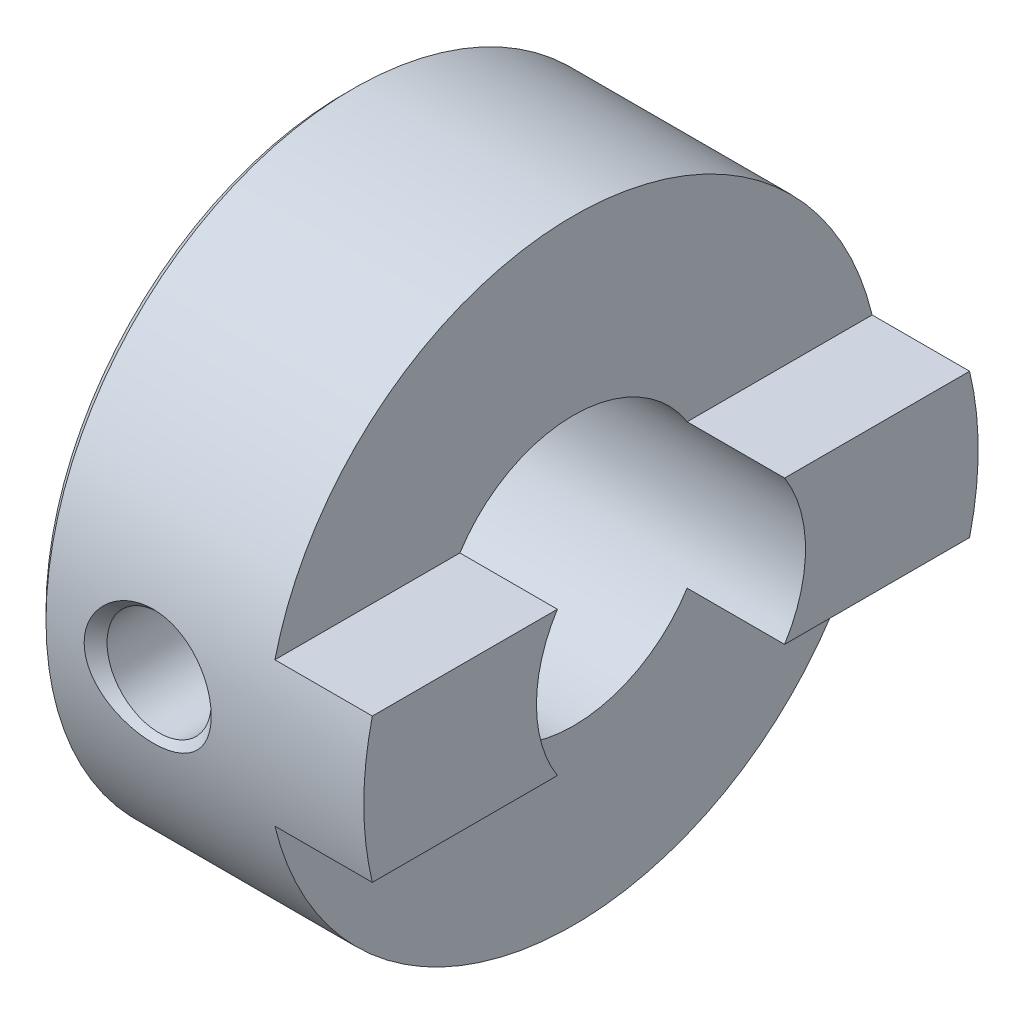
ISO-10303-21;
HEADER;
FILE_DESCRIPTION(('STEP AP214'),'2;1');
FILE_NAME('part.step','',(''),(''),'','','');
FILE_SCHEMA(('AUTOMOTIVE_DESIGN { 1 0 10303 214 1 1 1 1 }'));
ENDSEC;
DATA;
#1=APPLICATION_CONTEXT('core data for automotive mechanical design processes');
#2=APPLICATION_PROTOCOL_DEFINITION('international standard','automotive_design',2000,#1);
#3=PRODUCT_CONTEXT('',#1,'mechanical');
#4=PRODUCT('Part','Part','',(#3));
#5=PRODUCT_RELATED_PRODUCT_CATEGORY('part','',(#4));
#6=PRODUCT_DEFINITION_FORMATION('','',#4);
#7=PRODUCT_DEFINITION_CONTEXT('part definition',#1,'design');
#8=PRODUCT_DEFINITION('design','',#6,#7);
#9=PRODUCT_DEFINITION_SHAPE('','',#8);
#10=(LENGTH_UNIT() NAMED_UNIT(*) SI_UNIT(.MILLI.,.METRE.));
#11=(NAMED_UNIT(*) PLANE_ANGLE_UNIT() SI_UNIT($,.RADIAN.));
#12=(NAMED_UNIT(*) SI_UNIT($,.STERADIAN.) SOLID_ANGLE_UNIT());
#13=UNCERTAINTY_MEASURE_WITH_UNIT(LENGTH_MEASURE(1.E-05),#10,'distance_accuracy_value','');
#14=(GEOMETRIC_REPRESENTATION_CONTEXT(3) GLOBAL_UNCERTAINTY_ASSIGNED_CONTEXT((#13)) GLOBAL_UNIT_ASSIGNED_CONTEXT((#10,
#11,#12)) REPRESENTATION_CONTEXT('',''));
#15=CARTESIAN_POINT('',(0.,0.,0.));
#16=DIRECTION('',(0.,0.,1.));
#17=DIRECTION('',(1.,0.,0.));
#18=AXIS2_PLACEMENT_3D('',#15,#16,#17);
#19=CARTESIAN_POINT('',(7.7,0.,0.));
#20=DIRECTION('',(-1.,0.,0.));
#21=DIRECTION('',(0.,0.,1.));
#22=AXIS2_PLACEMENT_3D('',#19,#20,#21);
#23=CYLINDRICAL_SURFACE('',#22,3.175);
#24=CARTESIAN_POINT('',(3.8295,0.,3.175));
#25=CARTESIAN_POINT('',(3.82950316246884,-0.0664294786624814,3.17500242171082));
#26=CARTESIAN_POINT('',(3.82409970065885,-0.132838065182367,3.17289740345891));
#27=CARTESIAN_POINT('',(3.80272302614391,-0.263662191692079,3.16471157372536));
#28=CARTESIAN_POINT('',(3.78675208960495,-0.328078157752621,3.15863161842291));
#29=CARTESIAN_POINT('',(3.74489567083876,-0.45301065022601,3.14314592971077));
#30=CARTESIAN_POINT('',(3.71903008561927,-0.513534719326037,3.13374687353099));
#31=CARTESIAN_POINT('',(3.65822329725336,-0.629377660679996,3.11255213427139));
#32=CARTESIAN_POINT('',(3.62327949964512,-0.684695038747165,3.10075576627415));
#33=CARTESIAN_POINT('',(3.54367455872433,-0.791035180010789,3.07538584353735));
#34=CARTESIAN_POINT('',(3.49867774299579,-0.841793994349157,3.06175972901248));
#35=CARTESIAN_POINT('',(3.40095665963792,-0.935260844078306,3.03451586390156));
#36=CARTESIAN_POINT('',(3.34822980372346,-0.977966171889661,3.02089811765716));
#37=CARTESIAN_POINT('',(3.2339014883202,-1.05584839340471,2.99459033864622));
#38=CARTESIAN_POINT('',(3.17202400868627,-1.09064290099374,2.98196159194098));
#39=CARTESIAN_POINT('',(3.04273052700977,-1.14921295081486,2.95988540722387));
#40=CARTESIAN_POINT('',(2.97531691931914,-1.17299322741403,2.95043660282107));
#41=CARTESIAN_POINT('',(2.83991046641405,-1.20780198961705,2.93635492395465));
#42=CARTESIAN_POINT('',(2.7720681937236,-1.2193365374969,2.93153179784331));
#43=CARTESIAN_POINT('',(2.63525269813805,-1.23090815476872,2.92669326990316));
#44=CARTESIAN_POINT('',(2.56627999696491,-1.23095038659577,2.926675709378));
#45=CARTESIAN_POINT('',(2.43390134046448,-1.219921395121,2.93128711875885));
#46=CARTESIAN_POINT('',(2.37042326394498,-1.20956678141105,2.93561647412533));
#47=CARTESIAN_POINT('',(2.24618813971726,-1.17922763129579,2.94793358209464));
#48=CARTESIAN_POINT('',(2.18543153182478,-1.15924154444395,2.95592192370015));
#49=CARTESIAN_POINT('',(2.06695492679602,-1.1098356273499,2.97482751316337));
#50=CARTESIAN_POINT('',(2.00931818472526,-1.08023794003098,2.98579929035468));
#51=CARTESIAN_POINT('',(1.89962723965293,-1.01257334745646,3.00941888025505));
#52=CARTESIAN_POINT('',(1.84757506120429,-0.974503386049255,3.02206729710065));
#53=CARTESIAN_POINT('',(1.74658507485101,-0.887748092660002,3.04872579844004));
#54=CARTESIAN_POINT('',(1.6981418255311,-0.838495573955579,3.06276833255792));
#55=CARTESIAN_POINT('',(1.61005006189641,-0.732409599940694,3.08985362345725));
#56=CARTESIAN_POINT('',(1.57040308449492,-0.675574822606826,3.10289620526366));
#57=CARTESIAN_POINT('',(1.50043462435897,-0.554608212120451,3.12680287609899));
#58=CARTESIAN_POINT('',(1.47028812675353,-0.490366261076633,3.13762493401223));
#59=CARTESIAN_POINT('',(1.42139748327029,-0.357198298426019,3.15555664038321));
#60=CARTESIAN_POINT('',(1.40264792277544,-0.288274528454487,3.16266805151943));
#61=CARTESIAN_POINT('',(1.37805795697732,-0.15185367375074,3.17206181736049));
#62=CARTESIAN_POINT('',(1.37155223380326,-0.0844935413936949,3.17459274693974));
#63=CARTESIAN_POINT('',(1.36968417878421,0.0503962914320503,3.175315707468));
#64=CARTESIAN_POINT('',(1.37431917836445,0.117925947423478,3.17350877747921));
#65=CARTESIAN_POINT('',(1.39410302264331,0.248295215672026,3.16592251992033));
#66=CARTESIAN_POINT('',(1.40880721857212,0.31121313305388,3.1603112880336));
#67=CARTESIAN_POINT('',(1.44771717925287,0.433637927550875,3.14585211761305));
#68=CARTESIAN_POINT('',(1.47192417476042,0.493144361683031,3.1370037598328));
#69=CARTESIAN_POINT('',(1.52993544136872,0.609064147618344,3.11660636520741));
#70=CARTESIAN_POINT('',(1.56400618179325,0.6653308750305,3.10498418164638));
#71=CARTESIAN_POINT('',(1.64047944592404,0.771541907295075,3.0803126270155));
#72=CARTESIAN_POINT('',(1.68288518155893,0.821483762590919,3.06726270662298));
#73=CARTESIAN_POINT('',(1.77790884647394,0.916865968275205,3.04016304166223));
#74=CARTESIAN_POINT('',(1.83099645793678,0.961836253982579,3.02610141386114));
#75=CARTESIAN_POINT('',(1.94422855623846,1.0423337088102,2.99932826062202));
#76=CARTESIAN_POINT('',(2.00437391547201,1.07785970876432,2.98661690245899));
#77=CARTESIAN_POINT('',(2.13069956122794,1.13858173576398,2.96400385876961));
#78=CARTESIAN_POINT('',(2.1969174478101,1.16370723410117,2.95412149231091));
#79=CARTESIAN_POINT('',(2.33313823199498,1.20227155230261,2.93864054010872));
#80=CARTESIAN_POINT('',(2.40313853871493,1.21571826676033,2.93303906089038));
#81=CARTESIAN_POINT('',(2.5398062152297,1.22981371910523,2.92715494644977));
#82=CARTESIAN_POINT('',(2.60637635224522,1.23127088041512,2.92653639039825));
#83=CARTESIAN_POINT('',(2.73876190823769,1.22344211413962,2.92981777532719));
#84=CARTESIAN_POINT('',(2.80457740840373,1.21415735340837,2.93371722553389));
#85=CARTESIAN_POINT('',(2.93125456579968,1.18575307894,2.94530740775133));
#86=CARTESIAN_POINT('',(2.9922088827975,1.16698626154698,2.95286178980767));
#87=CARTESIAN_POINT('',(3.11013401149452,1.12047047082128,2.97082301759447));
#88=CARTESIAN_POINT('',(3.16710378157627,1.09271915940668,2.98123060572154));
#89=CARTESIAN_POINT('',(3.27884320098191,1.02725939939782,3.00443509962584));
#90=CARTESIAN_POINT('',(3.33332084154298,0.989088343570475,3.01733173875499));
#91=CARTESIAN_POINT('',(3.43535451832667,0.904569127372589,3.04373758783183));
#92=CARTESIAN_POINT('',(3.4829082730104,0.858218282700795,3.05724699778344));
#93=CARTESIAN_POINT('',(3.57262437368685,0.755378517404859,3.0843174626388));
#94=CARTESIAN_POINT('',(3.61430056429662,0.698451728564056,3.09783418362939));
#95=CARTESIAN_POINT('',(3.68749508121642,0.577924416879842,3.12256483370283));
#96=CARTESIAN_POINT('',(3.71901144259004,0.51432260621962,3.13377831718181));
#97=CARTESIAN_POINT('',(3.77260616532754,0.377414206547188,3.15329782902954));
#98=CARTESIAN_POINT('',(3.79384997695808,0.303738935517641,3.16133909682498));
#99=CARTESIAN_POINT('',(3.82229090075786,0.153365285372539,3.1721872314497));
#100=CARTESIAN_POINT('',(3.82949635007727,0.0766687281795287,3.17499720501361));
#101=CARTESIAN_POINT('',(3.8295,0.,3.175));
#102=B_SPLINE_CURVE_WITH_KNOTS('',3,(#24,#25,#26,#27,#28,#29,#30,#31,#32,#33,#34,#35,#36,#37,
#38,#39,#40,#41,#42,#43,#44,#45,#46,#47,#48,#49,#50,#51,#52,#53,#54,#55,#56,#57,#58,#59,#60,#61,
#62,#63,#64,#65,#66,#67,#68,#69,#70,#71,#72,#73,#74,#75,#76,#77,#78,#79,#80,#81,#82,#83,#84,#85,
#86,#87,#88,#89,#90,#91,#92,#93,#94,#95,#96,#97,#98,#99,#100,#101),.UNSPECIFIED.,.T.,.F.,(4,2,2,
2,2,2,2,2,2,2,2,2,2,2,2,2,2,2,2,2,2,2,2,2,2,2,2,2,2,2,2,2,2,2,2,2,2,2,4),(0.,0.199005470181675,
0.39796808981478,0.596532703801355,0.795154128103827,1.00180347461819,1.2085221731946,
1.42375253392836,1.63889029379275,1.84474285807861,2.05050295168676,2.24299212255152,
2.43551229011893,2.63181995585152,2.82819854956068,3.03872538451194,3.24928897448,
3.46353048999625,3.67767014092538,3.87979411844367,4.08186968535122,4.2755527831046,
4.46926097401526,4.66878843484423,4.86839293577599,5.08035414747807,5.29234158695384,
5.50574391026678,5.71900186591472,5.91775169698551,6.11647994064497,6.30830755950376,
6.50018513884909,6.70258577964042,6.90505296469568,7.11951218014423,7.33401284769258,
7.56382897652126,7.79350857971549),.UNSPECIFIED.);
#103=CARTESIAN_POINT('',(3.8295,0.,3.175));
#104=VERTEX_POINT('',#103);
#105=EDGE_CURVE('E147',#104,#104,#102,.T.);
#106=ORIENTED_EDGE('',*,*,#105,.F.);
#107=EDGE_LOOP('',(#106));
#108=FACE_BOUND('',#107,.T.);
#109=CARTESIAN_POINT('',(0.,0.,0.));
#110=DIRECTION('',(-1.,0.,0.));
#111=DIRECTION('',(0.,0.,1.));
#112=AXIS2_PLACEMENT_3D('',#109,#110,#111);
#113=CIRCLE('',#112,3.175);
#114=CARTESIAN_POINT('',(0.,0.,3.175));
#115=VERTEX_POINT('',#114);
#116=EDGE_CURVE('E200',#115,#115,#113,.T.);
#117=ORIENTED_EDGE('',*,*,#116,.T.);
#118=EDGE_LOOP('',(#117));
#119=FACE_BOUND('',#118,.T.);
#120=DIRECTION('',(-1.,0.,0.));
#121=VECTOR('',#120,1.);
#122=CARTESIAN_POINT('',(7.7,1.7,-2.68153407586031));
#123=LINE('',#122,#121);
#124=CARTESIAN_POINT('',(5.4,1.7,-2.68153407586031));
#125=VERTEX_POINT('',#124);
#126=CARTESIAN_POINT('',(7.7,1.7,-2.68153407586031));
#127=VERTEX_POINT('',#126);
#128=EDGE_CURVE('E215',#125,#127,#123,.F.);
#129=ORIENTED_EDGE('',*,*,#128,.F.);
#130=CARTESIAN_POINT('',(5.4,0.,0.));
#131=DIRECTION('',(1.,0.,0.));
#132=DIRECTION('',(0.,0.,-1.));
#133=AXIS2_PLACEMENT_3D('',#130,#131,#132);
#134=CIRCLE('',#133,3.175);
#135=CARTESIAN_POINT('',(5.4,1.7,2.68153407586031));
#136=VERTEX_POINT('',#135);
#137=EDGE_CURVE('E213',#136,#125,#134,.F.);
#138=ORIENTED_EDGE('',*,*,#137,.F.);
#139=DIRECTION('',(-1.,0.,0.));
#140=VECTOR('',#139,1.);
#141=CARTESIAN_POINT('',(7.7,1.7,2.68153407586031));
#142=LINE('',#141,#140);
#143=CARTESIAN_POINT('',(7.7,1.7,2.68153407586031));
#144=VERTEX_POINT('',#143);
#145=EDGE_CURVE('E217',#144,#136,#142,.T.);
#146=ORIENTED_EDGE('',*,*,#145,.F.);
#147=CARTESIAN_POINT('',(7.7,0.,0.));
#148=DIRECTION('',(-1.,0.,0.));
#149=DIRECTION('',(0.,0.,1.));
#150=AXIS2_PLACEMENT_3D('',#147,#148,#149);
#151=CIRCLE('',#150,3.175);
#152=CARTESIAN_POINT('',(7.7,-1.7,2.68153407586031));
#153=VERTEX_POINT('',#152);
#154=EDGE_CURVE('E113',#153,#144,#151,.T.);
#155=ORIENTED_EDGE('',*,*,#154,.F.);
#156=DIRECTION('',(-1.,0.,0.));
#157=VECTOR('',#156,1.);
#158=CARTESIAN_POINT('',(7.7,-1.7,2.68153407586031));
#159=LINE('',#158,#157);
#160=CARTESIAN_POINT('',(5.4,-1.7,2.68153407586031));
#161=VERTEX_POINT('',#160);
#162=EDGE_CURVE('E122',#161,#153,#159,.F.);
#163=ORIENTED_EDGE('',*,*,#162,.F.);
#164=CARTESIAN_POINT('',(5.4,-1.7,-2.68153407586031));
#165=VERTEX_POINT('',#164);
#166=EDGE_CURVE('E212',#165,#161,#134,.F.);
#167=ORIENTED_EDGE('',*,*,#166,.F.);
#168=DIRECTION('',(-1.,0.,0.));
#169=VECTOR('',#168,1.);
#170=CARTESIAN_POINT('',(7.7,-1.7,-2.68153407586031));
#171=LINE('',#170,#169);
#172=CARTESIAN_POINT('',(7.7,-1.7,-2.68153407586031));
#173=VERTEX_POINT('',#172);
#174=EDGE_CURVE('E220',#173,#165,#171,.T.);
#175=ORIENTED_EDGE('',*,*,#174,.F.);
#176=EDGE_CURVE('E205',#127,#173,#151,.T.);
#177=ORIENTED_EDGE('',*,*,#176,.F.);
#178=EDGE_LOOP('',(#129,#138,#146,#155,#163,#167,#175,#177));
#179=FACE_BOUND('',#178,.T.);
#180=CARTESIAN_POINT('',(2.6,-2.92727770291785,-1.2295));
#181=CARTESIAN_POINT('',(2.53378234428708,-2.92727447725564,-1.2295033349059));
#182=CARTESIAN_POINT('',(2.46758575700933,-2.92954885916848,-1.22413289048631));
#183=CARTESIAN_POINT('',(2.33719884888499,-2.93833101541691,-1.20289941102294));
#184=CARTESIAN_POINT('',(2.27300836988018,-2.94483845513844,-1.18703720532851));
#185=CARTESIAN_POINT('',(2.14855726051629,-2.96124138619425,-1.14549809796639));
#186=CARTESIAN_POINT('',(2.08828709857205,-2.97112826415673,-1.11984612886075));
#187=CARTESIAN_POINT('',(1.97288176950382,-2.99316174761616,-1.05954476190847));
#188=CARTESIAN_POINT('',(1.91774825513378,-3.00530907668741,-1.02489248163714));
#189=CARTESIAN_POINT('',(1.81125464900736,-3.03121684305942,-0.945604490201634));
#190=CARTESIAN_POINT('',(1.76020527323169,-3.04502684733286,-0.900567536544086));
#191=CARTESIAN_POINT('',(1.66616271822666,-3.07229196898108,-0.802638410729982));
#192=CARTESIAN_POINT('',(1.62317140781496,-3.08574700341149,-0.749744421464237));
#193=CARTESIAN_POINT('',(1.5449404171268,-3.11138028141572,-0.635216755130681));
#194=CARTESIAN_POINT('',(1.5100423466833,-3.12349370613119,-0.573333921432767));
#195=CARTESIAN_POINT('',(1.45128264816101,-3.14447923435929,-0.444023058703526));
#196=CARTESIAN_POINT('',(1.42741691760082,-3.15335254248208,-0.376597101939241));
#197=CARTESIAN_POINT('',(1.39250074763536,-3.16650587193296,-0.241383276582414));
#198=CARTESIAN_POINT('',(1.38091452155859,-3.17097726441066,-0.173752748130027));
#199=CARTESIAN_POINT('',(1.36916538055243,-3.1755121185208,-0.0373692937817417));
#200=CARTESIAN_POINT('',(1.36899850394513,-3.17557710885198,0.0313832345825042));
#201=CARTESIAN_POINT('',(1.37978963741684,-3.17141100778039,0.164203193620192));
#202=CARTESIAN_POINT('',(1.39016180204822,-3.16740614996269,0.22832657691708));
#203=CARTESIAN_POINT('',(1.42074579721794,-3.15585104073878,0.353840496131779));
#204=CARTESIAN_POINT('',(1.44095832889812,-3.14830053670098,0.415230836975718));
#205=CARTESIAN_POINT('',(1.49090083859646,-3.13025676364726,0.53462132056629));
#206=CARTESIAN_POINT('',(1.5207676117599,-3.119721484509,0.592557628630519));
#207=CARTESIAN_POINT('',(1.58904645402372,-3.09676435886255,0.702743016993319));
#208=CARTESIAN_POINT('',(1.62746137277598,-3.08434188366861,0.754990192063797));
#209=CARTESIAN_POINT('',(1.71452576913372,-3.057972403779,0.855750371768536));
#210=CARTESIAN_POINT('',(1.76366206442718,-3.04397863008215,0.903831127973081));
#211=CARTESIAN_POINT('',(1.86937054081697,-3.01664888024005,0.99123989565558));
#212=CARTESIAN_POINT('',(1.92594484545807,-3.00331309345049,1.03056539884829));
#213=CARTESIAN_POINT('',(2.04673787169922,-2.978503098593,1.10025043454689));
#214=CARTESIAN_POINT('',(2.11111249470305,-2.96708384361359,1.13036089884581));
#215=CARTESIAN_POINT('',(2.2445781350338,-2.94803892035061,1.17914612552284));
#216=CARTESIAN_POINT('',(2.31366628954056,-2.94041097229187,1.19782776180725));
#217=CARTESIAN_POINT('',(2.4503053115139,-2.93035755033077,1.22220889351825));
#218=CARTESIAN_POINT('',(2.51771229108593,-2.9276555685692,1.22859957209785));
#219=CARTESIAN_POINT('',(2.65267488195268,-2.92697472863694,1.23022211360479));
#220=CARTESIAN_POINT('',(2.7202304473381,-2.92899457339036,1.22545704099318));
#221=CARTESIAN_POINT('',(2.84988856904111,-2.93724752297979,1.20553137595058));
#222=CARTESIAN_POINT('',(2.912092084372,-2.94325628175483,1.19092373025187));
#223=CARTESIAN_POINT('',(3.03313073779797,-2.95853802652827,1.15243367872726));
#224=CARTESIAN_POINT('',(3.09196515519858,-2.96781170792645,1.12854929692624));
#225=CARTESIAN_POINT('',(3.20715298860607,-2.98902256971011,1.07113851231948));
#226=CARTESIAN_POINT('',(3.263319904264,-3.00104959099577,1.0372721193235));
#227=CARTESIAN_POINT('',(3.36941750459636,-3.02626784536557,0.961213437202177));
#228=CARTESIAN_POINT('',(3.41934576707835,-3.03945952726442,0.919017930552712));
#229=CARTESIAN_POINT('',(3.51509473974276,-3.06661067394391,0.824087559200897));
#230=CARTESIAN_POINT('',(3.56040093771076,-3.08056094048054,0.770829232628137));
#231=CARTESIAN_POINT('',(3.64150346992613,-3.10680039187676,0.657127259244025));
#232=CARTESIAN_POINT('',(3.6772996117933,-3.11908954313095,0.596683467112719));
#233=CARTESIAN_POINT('',(3.73817596336226,-3.14063497402499,0.470250929478883));
#234=CARTESIAN_POINT('',(3.76327768887067,-3.1498973343475,0.404273640007401));
#235=CARTESIAN_POINT('',(3.8018727678197,-3.16435287357065,0.268589141831316));
#236=CARTESIAN_POINT('',(3.81537198631318,-3.16954810827966,0.198883836586004));
#237=CARTESIAN_POINT('',(3.82971552703873,-3.17507729643101,0.0623571377081368));
#238=CARTESIAN_POINT('',(3.83128906517286,-3.1756913359891,-0.00437693747971259));
#239=CARTESIAN_POINT('',(3.82363644482033,-3.17273195328415,-0.137121263174393));
#240=CARTESIAN_POINT('',(3.81441173895639,-3.16915909425929,-0.20313160983442));
#241=CARTESIAN_POINT('',(3.78594168078707,-3.158361371623,-0.330710673887424));
#242=CARTESIAN_POINT('',(3.76697755070978,-3.15123915695613,-0.392351512884612));
#243=CARTESIAN_POINT('',(3.71985427995114,-3.13409447162417,-0.511573914997663));
#244=CARTESIAN_POINT('',(3.6916933991351,-3.12407145213316,-0.56915470739542));
#245=CARTESIAN_POINT('',(3.62559809016098,-3.10158037351156,-0.681351339134705));
#246=CARTESIAN_POINT('',(3.58729401365314,-3.08902539702572,-0.73573164799698));
#247=CARTESIAN_POINT('',(3.50256931164167,-3.06299885435048,-0.837512647768227));
#248=CARTESIAN_POINT('',(3.45614572018379,-3.049526954323,-0.88491077648069));
#249=CARTESIAN_POINT('',(3.35335232009472,-3.02223521994011,-0.97417800180739));
#250=CARTESIAN_POINT('',(3.29656581393226,-3.00843947540278,-1.01557655057913));
#251=CARTESIAN_POINT('',(3.17641098299774,-2.98291170213558,-1.0882796885473));
#252=CARTESIAN_POINT('',(3.1130411078322,-2.97118016128905,-1.11958189288236));
#253=CARTESIAN_POINT('',(2.97655739739214,-2.95057503469018,-1.17286675436243));
#254=CARTESIAN_POINT('',(2.90307021933721,-2.94197026194951,-1.19400937215126));
#255=CARTESIAN_POINT('',(2.753044340204,-2.93032566523828,-1.22231852873025));
#256=CARTESIAN_POINT('',(2.67650810737328,-2.92728142985906,-1.22949614683824));
#257=CARTESIAN_POINT('',(2.6,-2.92727770291785,-1.2295));
#258=B_SPLINE_CURVE_WITH_KNOTS('',3,(#180,#181,#182,#183,#184,#185,#186,#187,#188,#189,#190,
#191,#192,#193,#194,#195,#196,#197,#198,#199,#200,#201,#202,#203,#204,#205,#206,#207,#208,#209,
#210,#211,#212,#213,#214,#215,#216,#217,#218,#219,#220,#221,#222,#223,#224,#225,#226,#227,#228,
#229,#230,#231,#232,#233,#234,#235,#236,#237,#238,#239,#240,#241,#242,#243,#244,#245,#246,#247,
#248,#249,#250,#251,#252,#253,#254,#255,#256,#257),.UNSPECIFIED.,.T.,.F.,(4,2,2,2,2,2,2,2,2,2,2,
2,2,2,2,2,2,2,2,2,2,2,2,2,2,2,2,2,2,2,2,2,2,2,2,2,2,2,4),(0.,0.198367600022195,
0.396719521420282,0.59456961548729,0.792483150993539,0.999952413391158,1.20746973245732,
1.42258810127053,1.6376264117784,1.84283805377353,2.04797850199758,2.24230754284546,
2.43665043197409,2.63387753430372,2.83117048399337,3.0406935047122,3.2502764744873,
3.46510554553453,3.67980527957006,3.88203130286329,4.08420178161789,4.27586877096116,
4.4675766084087,4.66676794070655,4.8660363714369,5.07893409357242,5.29183612211677,
5.50430777264766,5.71667195574902,5.91593715603143,6.11517555344704,6.30895991096501,
6.50278095605379,6.70497470239382,6.90724246235379,7.12106530775423,7.33493862340539,
7.56431528471911,7.79350989269005),.UNSPECIFIED.);
#259=CARTESIAN_POINT('',(2.6,-2.92727770291785,-1.2295));
#260=VERTEX_POINT('',#259);
#261=EDGE_CURVE('E35',#260,#260,#258,.T.);
#262=ORIENTED_EDGE('',*,*,#261,.F.);
#263=EDGE_LOOP('',(#262));
#264=FACE_BOUND('',#263,.T.);
#265=ADVANCED_FACE('F31',(#108,#119,#179,#264),#23,.F.);
#266=CARTESIAN_POINT('',(7.7,0.,0.));
#267=DIRECTION('',(-1.,0.,0.));
#268=DIRECTION('',(0.,0.,1.));
#269=AXIS2_PLACEMENT_3D('',#266,#267,#268);
#270=CYLINDRICAL_SURFACE('',#269,7.25);
#271=CARTESIAN_POINT('',(1.58200830564529,-1.00441187640881,7.18008752364289));
#272=CARTESIAN_POINT('',(1.63578489278405,-1.04986168617137,7.17372987099769));
#273=CARTESIAN_POINT('',(1.69285744622883,-1.0914437843685,7.16747414093581));
#274=CARTESIAN_POINT('',(1.81228966583431,-1.16634368468239,7.15566782402923));
#275=CARTESIAN_POINT('',(1.87465392529839,-1.19965420638385,7.15011786046206));
#276=CARTESIAN_POINT('',(2.01679932362037,-1.26362766588196,7.13911876735613));
#277=CARTESIAN_POINT('',(2.09750518380208,-1.29229902644037,7.13393068599323));
#278=CARTESIAN_POINT('',(2.26255781731959,-1.33649004443632,7.12578417882237));
#279=CARTESIAN_POINT('',(2.34690619475528,-1.35200384414861,7.12282674616046));
#280=CARTESIAN_POINT('',(2.52065223150985,-1.36998996712848,7.11939043620564));
#281=CARTESIAN_POINT('',(2.61011263231742,-1.37188343237519,7.11902158797866));
#282=CARTESIAN_POINT('',(2.78811433738971,-1.36105760290706,7.12109896292041));
#283=CARTESIAN_POINT('',(2.87665557697855,-1.34833728684657,7.12354538284604));
#284=CARTESIAN_POINT('',(3.05121935555725,-1.30830613276614,7.13100637247181));
#285=CARTESIAN_POINT('',(3.13720746776744,-1.2808493751554,7.13604660507981));
#286=CARTESIAN_POINT('',(3.30315769567977,-1.21173912671794,7.14810554203639));
#287=CARTESIAN_POINT('',(3.38311937379568,-1.17008460618597,7.15512438987939));
#288=CARTESIAN_POINT('',(3.53281939111721,-1.07436014228975,7.17011449381119));
#289=CARTESIAN_POINT('',(3.60273478873325,-1.02056442954647,7.17806308179058));
#290=CARTESIAN_POINT('',(3.73168457584752,-0.901188410845225,7.19402326752565));
#291=CARTESIAN_POINT('',(3.79072313502557,-0.835612639940881,7.20203483990277));
#292=CARTESIAN_POINT('',(3.89176983510201,-0.699065767687178,7.21652215909619));
#293=CARTESIAN_POINT('',(3.9346557785529,-0.628753310889177,7.22306493275218));
#294=CARTESIAN_POINT('',(4.00658864830554,-0.481245793876791,7.23438650365962));
#295=CARTESIAN_POINT('',(4.03564736039825,-0.404056661946941,7.23916680239026));
#296=CARTESIAN_POINT('',(4.07618067207471,-0.253293693342394,7.24592730796786));
#297=CARTESIAN_POINT('',(4.08911394050319,-0.180121088254738,7.24813828678803));
#298=CARTESIAN_POINT('',(4.10176888975318,-0.0326184047054376,7.25030100569326));
#299=CARTESIAN_POINT('',(4.10149631308732,0.041711156601682,7.25025372777298));
#300=CARTESIAN_POINT('',(4.08820817586898,0.184383945543079,7.24798414988832));
#301=CARTESIAN_POINT('',(4.07600481823865,0.252807068196405,7.24590048292978));
#302=CARTESIAN_POINT('',(4.04060949728902,0.386657988093955,7.23999211790296));
#303=CARTESIAN_POINT('',(4.01741713207762,0.452085675692575,7.23616735615924));
#304=CARTESIAN_POINT('',(3.96051204781662,0.579435634433251,7.22709524930008));
#305=CARTESIAN_POINT('',(3.92662374278215,0.64127736804729,7.22182436848898));
#306=CARTESIAN_POINT('',(3.8497192608264,0.758894573948918,7.21041449239855));
#307=CARTESIAN_POINT('',(3.80670040557847,0.814668258977202,7.20427524257127));
#308=CARTESIAN_POINT('',(3.70914137095142,0.923325338320132,7.19118919407236));
#309=CARTESIAN_POINT('',(3.65395734780279,0.975626981988899,7.18421698925729));
#310=CARTESIAN_POINT('',(3.53619073599058,1.07114619999515,7.17059821491746));
#311=CARTESIAN_POINT('',(3.47360525829482,1.11436020872209,7.16395177399041));
#312=CARTESIAN_POINT('',(3.33665332172002,1.19458953746153,7.15103215175697));
#313=CARTESIAN_POINT('',(3.26173286710323,1.23067513006905,7.14484885376223));
#314=CARTESIAN_POINT('',(3.10705718425124,1.29069806927207,7.13425045930504));
#315=CARTESIAN_POINT('',(3.02730052661362,1.31463180444377,7.12983588857469));
#316=CARTESIAN_POINT('',(2.8600321862052,1.35105018722601,7.12302843823919));
#317=CARTESIAN_POINT('',(2.77234356407695,1.36275222818191,7.1207744451249));
#318=CARTESIAN_POINT('',(2.59619523462123,1.37185894546039,7.11902547397831));
#319=CARTESIAN_POINT('',(2.50773540865226,1.36926138175978,7.11953092821143));
#320=CARTESIAN_POINT('',(2.33061126879319,1.34960613141039,7.12328338346153));
#321=CARTESIAN_POINT('',(2.24198131585001,1.33224738498813,7.12658745781934));
#322=CARTESIAN_POINT('',(2.06897237582656,1.28297633307368,7.13562151934399));
#323=CARTESIAN_POINT('',(1.98459381058273,1.25106258653289,7.14135174671321));
#324=CARTESIAN_POINT('',(1.82339727023525,1.17360665959709,7.15448608356551));
#325=CARTESIAN_POINT('',(1.74651841092376,1.12818895340395,7.16187475988556));
#326=CARTESIAN_POINT('',(1.60205504614399,1.02447186153392,7.17744361372084));
#327=CARTESIAN_POINT('',(1.53446899231729,0.966174626061896,7.18562365899105));
#328=CARTESIAN_POINT('',(1.41434197676091,0.841167557071238,7.20129836482031));
#329=CARTESIAN_POINT('',(1.36122070886127,0.775018991504764,7.20880689105407));
#330=CARTESIAN_POINT('',(1.26817419775783,0.63389110916314,7.22258155112997));
#331=CARTESIAN_POINT('',(1.22823870201042,0.558918715143412,7.22884864871574));
#332=CARTESIAN_POINT('',(1.16673090415709,0.409859581690512,7.23875387776177));
#333=CARTESIAN_POINT('',(1.1437848535595,0.336352629089151,7.2425838198878));
#334=CARTESIAN_POINT('',(1.11166697875233,0.186318789306052,7.24799293238601));
#335=CARTESIAN_POINT('',(1.10248608704101,0.109793924240928,7.2495735843946));
#336=CARTESIAN_POINT('',(1.09856708002886,-0.0371624105618861,7.2502458733885));
#337=CARTESIAN_POINT('',(1.10267880857037,-0.107564850675874,7.24953573502622));
#338=CARTESIAN_POINT('',(1.12266051183263,-0.246628476202496,7.24613765697439));
#339=CARTESIAN_POINT('',(1.1385305372985,-0.315289654099066,7.24344970874923));
#340=CARTESIAN_POINT('',(1.18105536096362,-0.44820883014545,7.23643532002251));
#341=CARTESIAN_POINT('',(1.20758616009768,-0.512507843662707,7.23212775367172));
#342=CARTESIAN_POINT('',(1.27036332146251,-0.636038184498317,7.22231246455589));
#343=CARTESIAN_POINT('',(1.30660754976289,-0.69527062112042,7.21680500544335));
#344=CARTESIAN_POINT('',(1.38084391813178,-0.79820968952281,7.20607963615762));
#345=CARTESIAN_POINT('',(1.4175529831974,-0.842863136661078,7.2009647742634));
#346=CARTESIAN_POINT('',(1.49610740984216,-0.927346361084062,7.19057295923222));
#347=CARTESIAN_POINT('',(1.5379517769681,-0.967177069335422,7.18529603762613));
#348=CARTESIAN_POINT('',(1.58200830564529,-1.00441187640881,7.18008752364289));
#349=B_SPLINE_CURVE_WITH_KNOTS('',3,(#271,#272,#273,#274,#275,#276,#277,#278,#279,#280,#281,
#282,#283,#284,#285,#286,#287,#288,#289,#290,#291,#292,#293,#294,#295,#296,#297,#298,#299,#300,
#301,#302,#303,#304,#305,#306,#307,#308,#309,#310,#311,#312,#313,#314,#315,#316,#317,#318,#319,
#320,#321,#322,#323,#324,#325,#326,#327,#328,#329,#330,#331,#332,#333,#334,#335,#336,#337,#338,
#339,#340,#341,#342,#343,#344,#345,#346,#347,#348),.UNSPECIFIED.,.T.,.F.,(4,2,2,2,2,2,2,2,2,2,2,
2,2,2,2,2,2,2,2,2,2,2,2,2,2,2,2,2,2,2,2,2,2,2,2,2,2,2,4),(0.,0.211938643284731,
0.424063173171912,0.680306178414661,0.936663202843584,1.20385421472871,1.47106390151892,
1.74096966424346,2.01089500628775,2.27524467692895,2.53949279622624,2.78598439679511,
3.03226551954191,3.25410969475752,3.47585740272509,3.68349073542137,3.89113166230997,
4.10237599855491,4.31368238639661,4.54177808574879,4.76996311408858,5.01903918441396,
5.268189234664,5.5324533792992,5.79675892190776,6.06658804235083,6.33644388359847,
6.60388559171092,6.87128268480002,7.12540591048332,7.37933107579475,7.60937608477173,
7.83926948987682,8.04982077901012,8.26037297682207,8.46854395674077,8.67666924128815,
8.85033378723575,9.02396475588732),.UNSPECIFIED.);
#350=CARTESIAN_POINT('',(1.58200830564529,-1.00441187640881,7.18008752364289));
#351=VERTEX_POINT('',#350);
#352=EDGE_CURVE('E44',#351,#351,#349,.T.);
#353=ORIENTED_EDGE('',*,*,#352,.F.);
#354=EDGE_LOOP('',(#353));
#355=FACE_BOUND('',#354,.T.);
#356=CARTESIAN_POINT('',(0.2,0.,0.));
#357=DIRECTION('',(-1.,0.,0.));
#358=DIRECTION('',(0.,0.,1.));
#359=AXIS2_PLACEMENT_3D('',#356,#357,#358);
#360=CIRCLE('',#359,7.25);
#361=CARTESIAN_POINT('',(0.2,0.,7.25));
#362=VERTEX_POINT('',#361);
#363=EDGE_CURVE('E209',#362,#362,#360,.T.);
#364=ORIENTED_EDGE('',*,*,#363,.F.);
#365=EDGE_LOOP('',(#364));
#366=FACE_BOUND('',#365,.T.);
#367=DIRECTION('',(-1.,0.,0.));
#368=VECTOR('',#367,1.);
#369=CARTESIAN_POINT('',(7.7,1.7,-7.04787201926936));
#370=LINE('',#369,#368);
#371=CARTESIAN_POINT('',(7.7,1.7,-7.04787201926936));
#372=VERTEX_POINT('',#371);
#373=CARTESIAN_POINT('',(5.4,1.7,-7.04787201926936));
#374=VERTEX_POINT('',#373);
#375=EDGE_CURVE('E139',#372,#374,#370,.T.);
#376=ORIENTED_EDGE('',*,*,#375,.F.);
#377=CARTESIAN_POINT('',(7.7,0.,0.));
#378=DIRECTION('',(-1.,0.,0.));
#379=DIRECTION('',(0.,0.,1.));
#380=AXIS2_PLACEMENT_3D('',#377,#378,#379);
#381=CIRCLE('',#380,7.25);
#382=CARTESIAN_POINT('',(7.7,-1.7,-7.04787201926936));
#383=VERTEX_POINT('',#382);
#384=EDGE_CURVE('E114',#372,#383,#381,.T.);
#385=ORIENTED_EDGE('',*,*,#384,.T.);
#386=DIRECTION('',(-1.,0.,0.));
#387=VECTOR('',#386,1.);
#388=CARTESIAN_POINT('',(7.7,-1.7,-7.04787201926936));
#389=LINE('',#388,#387);
#390=CARTESIAN_POINT('',(5.4,-1.7,-7.04787201926936));
#391=VERTEX_POINT('',#390);
#392=EDGE_CURVE('E135',#391,#383,#389,.F.);
#393=ORIENTED_EDGE('',*,*,#392,.F.);
#394=CARTESIAN_POINT('',(5.4,0.,0.));
#395=DIRECTION('',(1.,0.,0.));
#396=DIRECTION('',(0.,0.,-1.));
#397=AXIS2_PLACEMENT_3D('',#394,#395,#396);
#398=CIRCLE('',#397,7.25);
#399=CARTESIAN_POINT('',(5.4,-1.7,7.04787201926936));
#400=VERTEX_POINT('',#399);
#401=EDGE_CURVE('E130',#400,#391,#398,.T.);
#402=ORIENTED_EDGE('',*,*,#401,.F.);
#403=DIRECTION('',(-1.,0.,0.));
#404=VECTOR('',#403,1.);
#405=CARTESIAN_POINT('',(7.7,-1.7,7.04787201926936));
#406=LINE('',#405,#404);
#407=CARTESIAN_POINT('',(7.7,-1.7,7.04787201926936));
#408=VERTEX_POINT('',#407);
#409=EDGE_CURVE('E119',#408,#400,#406,.T.);
#410=ORIENTED_EDGE('',*,*,#409,.F.);
#411=CARTESIAN_POINT('',(7.7,1.7,7.04787201926936));
#412=VERTEX_POINT('',#411);
#413=EDGE_CURVE('E103',#408,#412,#381,.T.);
#414=ORIENTED_EDGE('',*,*,#413,.T.);
#415=DIRECTION('',(-1.,0.,0.));
#416=VECTOR('',#415,1.);
#417=CARTESIAN_POINT('',(7.7,1.7,7.04787201926936));
#418=LINE('',#417,#416);
#419=CARTESIAN_POINT('',(5.4,1.7,7.04787201926936));
#420=VERTEX_POINT('',#419);
#421=EDGE_CURVE('E131',#420,#412,#418,.F.);
#422=ORIENTED_EDGE('',*,*,#421,.F.);
#423=EDGE_CURVE('E133',#374,#420,#398,.T.);
#424=ORIENTED_EDGE('',*,*,#423,.F.);
#425=EDGE_LOOP('',(#376,#385,#393,#402,#410,#414,#422,#424));
#426=FACE_BOUND('',#425,.T.);
#427=CARTESIAN_POINT('',(1.58200830564529,-7.18008752364289,-1.00441187640881));
#428=CARTESIAN_POINT('',(1.63578489278405,-7.17372987099769,-1.04986168617137));
#429=CARTESIAN_POINT('',(1.69285744622883,-7.16747414093581,-1.0914437843685));
#430=CARTESIAN_POINT('',(1.81228966583431,-7.15566782402923,-1.16634368468239));
#431=CARTESIAN_POINT('',(1.87465392529839,-7.15011786046206,-1.19965420638385));
#432=CARTESIAN_POINT('',(2.01679932362037,-7.13911876735613,-1.26362766588195));
#433=CARTESIAN_POINT('',(2.09750518380208,-7.13393068599323,-1.29229902644037));
#434=CARTESIAN_POINT('',(2.26255781731959,-7.12578417882237,-1.33649004443632));
#435=CARTESIAN_POINT('',(2.34690619475528,-7.12282674616046,-1.35200384414861));
#436=CARTESIAN_POINT('',(2.52065223150985,-7.11939043620564,-1.36998996712848));
#437=CARTESIAN_POINT('',(2.61011263231742,-7.11902158797866,-1.37188343237519));
#438=CARTESIAN_POINT('',(2.78811433738971,-7.12109896292041,-1.36105760290706));
#439=CARTESIAN_POINT('',(2.87665557697855,-7.12354538284604,-1.34833728684657));
#440=CARTESIAN_POINT('',(3.05121935555725,-7.13100637247181,-1.30830613276614));
#441=CARTESIAN_POINT('',(3.13720746776744,-7.13604660507981,-1.2808493751554));
#442=CARTESIAN_POINT('',(3.30315769567977,-7.14810554203639,-1.21173912671794));
#443=CARTESIAN_POINT('',(3.38311937379568,-7.15512438987939,-1.17008460618597));
#444=CARTESIAN_POINT('',(3.5328193911172,-7.17011449381119,-1.07436014228975));
#445=CARTESIAN_POINT('',(3.60273478873325,-7.17806308179058,-1.02056442954647));
#446=CARTESIAN_POINT('',(3.73168457584752,-7.19402326752565,-0.901188410845225));
#447=CARTESIAN_POINT('',(3.79072313502557,-7.20203483990277,-0.835612639940882));
#448=CARTESIAN_POINT('',(3.89176983510201,-7.21652215909619,-0.699065767687178));
#449=CARTESIAN_POINT('',(3.9346557785529,-7.22306493275218,-0.628753310889178));
#450=CARTESIAN_POINT('',(4.00658864830554,-7.23438650365962,-0.481245793876792));
#451=CARTESIAN_POINT('',(4.03564736039825,-7.23916680239026,-0.404056661946942));
#452=CARTESIAN_POINT('',(4.07618067207471,-7.24592730796786,-0.253293693342395));
#453=CARTESIAN_POINT('',(4.08911394050318,-7.24813828678803,-0.180121088254738));
#454=CARTESIAN_POINT('',(4.10176888975318,-7.25030100569326,-0.0326184047054377));
#455=CARTESIAN_POINT('',(4.10149631308732,-7.25025372777298,0.0417111566016818));
#456=CARTESIAN_POINT('',(4.08820817586898,-7.24798414988832,0.184383945543078));
#457=CARTESIAN_POINT('',(4.07600481823865,-7.24590048292978,0.252807068196405));
#458=CARTESIAN_POINT('',(4.04060949728902,-7.23999211790296,0.386657988093955));
#459=CARTESIAN_POINT('',(4.01741713207762,-7.23616735615924,0.452085675692574));
#460=CARTESIAN_POINT('',(3.96051204781662,-7.22709524930008,0.579435634433251));
#461=CARTESIAN_POINT('',(3.92662374278215,-7.22182436848898,0.64127736804729));
#462=CARTESIAN_POINT('',(3.8497192608264,-7.21041449239855,0.758894573948917));
#463=CARTESIAN_POINT('',(3.80670040557847,-7.20427524257127,0.814668258977201));
#464=CARTESIAN_POINT('',(3.70914137095142,-7.19118919407236,0.923325338320132));
#465=CARTESIAN_POINT('',(3.65395734780279,-7.18421698925729,0.975626981988899));
#466=CARTESIAN_POINT('',(3.53619073599058,-7.17059821491746,1.07114619999515));
#467=CARTESIAN_POINT('',(3.47360525829482,-7.16395177399041,1.11436020872209));
#468=CARTESIAN_POINT('',(3.33665332172002,-7.15103215175697,1.19458953746153));
#469=CARTESIAN_POINT('',(3.26173286710323,-7.14484885376223,1.23067513006905));
#470=CARTESIAN_POINT('',(3.10705718425124,-7.13425045930504,1.29069806927207));
#471=CARTESIAN_POINT('',(3.02730052661362,-7.12983588857469,1.31463180444377));
#472=CARTESIAN_POINT('',(2.8600321862052,-7.12302843823919,1.35105018722601));
#473=CARTESIAN_POINT('',(2.77234356407695,-7.1207744451249,1.36275222818191));
#474=CARTESIAN_POINT('',(2.59619523462123,-7.11902547397831,1.37185894546039));
#475=CARTESIAN_POINT('',(2.50773540865226,-7.11953092821143,1.36926138175978));
#476=CARTESIAN_POINT('',(2.33061126879319,-7.12328338346153,1.34960613141039));
#477=CARTESIAN_POINT('',(2.24198131585001,-7.12658745781934,1.33224738498813));
#478=CARTESIAN_POINT('',(2.06897237582656,-7.13562151934399,1.28297633307368));
#479=CARTESIAN_POINT('',(1.98459381058273,-7.14135174671321,1.25106258653289));
#480=CARTESIAN_POINT('',(1.82339727023525,-7.15448608356551,1.17360665959709));
#481=CARTESIAN_POINT('',(1.74651841092376,-7.16187475988556,1.12818895340395));
#482=CARTESIAN_POINT('',(1.602055046144,-7.17744361372084,1.02447186153392));
#483=CARTESIAN_POINT('',(1.53446899231729,-7.18562365899105,0.966174626061897));
#484=CARTESIAN_POINT('',(1.41434197676091,-7.20129836482031,0.84116755707124));
#485=CARTESIAN_POINT('',(1.36122070886127,-7.20880689105407,0.775018991504765));
#486=CARTESIAN_POINT('',(1.26817419775783,-7.22258155112997,0.633891109163142));
#487=CARTESIAN_POINT('',(1.22823870201042,-7.22884864871574,0.558918715143413));
#488=CARTESIAN_POINT('',(1.16673090415709,-7.23875387776177,0.409859581690513));
#489=CARTESIAN_POINT('',(1.1437848535595,-7.2425838198878,0.336352629089152));
#490=CARTESIAN_POINT('',(1.11166697875233,-7.24799293238601,0.186318789306053));
#491=CARTESIAN_POINT('',(1.10248608704101,-7.2495735843946,0.109793924240929));
#492=CARTESIAN_POINT('',(1.09856708002886,-7.2502458733885,-0.0371624105618858));
#493=CARTESIAN_POINT('',(1.10267880857037,-7.24953573502622,-0.107564850675874));
#494=CARTESIAN_POINT('',(1.12266051183263,-7.24613765697439,-0.246628476202496));
#495=CARTESIAN_POINT('',(1.1385305372985,-7.24344970874923,-0.315289654099065));
#496=CARTESIAN_POINT('',(1.18105536096362,-7.23643532002251,-0.448208830145449));
#497=CARTESIAN_POINT('',(1.20758616009768,-7.23212775367172,-0.512507843662706));
#498=CARTESIAN_POINT('',(1.27036332146251,-7.22231246455589,-0.636038184498316));
#499=CARTESIAN_POINT('',(1.3066075497629,-7.21680500544335,-0.695270621120419));
#500=CARTESIAN_POINT('',(1.38084391813178,-7.20607963615762,-0.798209689522809));
#501=CARTESIAN_POINT('',(1.4175529831974,-7.2009647742634,-0.842863136661076));
#502=CARTESIAN_POINT('',(1.49610740984216,-7.19057295923222,-0.927346361084061));
#503=CARTESIAN_POINT('',(1.5379517769681,-7.18529603762613,-0.967177069335421));
#504=CARTESIAN_POINT('',(1.58200830564529,-7.18008752364289,-1.00441187640881));
#505=B_SPLINE_CURVE_WITH_KNOTS('',3,(#427,#428,#429,#430,#431,#432,#433,#434,#435,#436,#437,
#438,#439,#440,#441,#442,#443,#444,#445,#446,#447,#448,#449,#450,#451,#452,#453,#454,#455,#456,
#457,#458,#459,#460,#461,#462,#463,#464,#465,#466,#467,#468,#469,#470,#471,#472,#473,#474,#475,
#476,#477,#478,#479,#480,#481,#482,#483,#484,#485,#486,#487,#488,#489,#490,#491,#492,#493,#494,
#495,#496,#497,#498,#499,#500,#501,#502,#503,#504),.UNSPECIFIED.,.T.,.F.,(4,2,2,2,2,2,2,2,2,2,2,
2,2,2,2,2,2,2,2,2,2,2,2,2,2,2,2,2,2,2,2,2,2,2,2,2,2,2,4),(0.,0.211938643284731,
0.424063173171911,0.68030617841466,0.936663202843583,1.20385421472871,1.47106390151892,
1.74096966424346,2.01089500628775,2.27524467692895,2.53949279622623,2.78598439679511,
3.0322655195419,3.25410969475752,3.47585740272509,3.68349073542137,3.89113166230996,
4.10237599855491,4.31368238639661,4.54177808574879,4.76996311408858,5.01903918441396,
5.268189234664,5.53245337929919,5.79675892190776,6.06658804235083,6.33644388359846,
6.60388559171092,6.87128268480002,7.12540591048331,7.37933107579475,7.60937608477172,
7.83926948987682,8.04982077901012,8.26037297682207,8.46854395674077,8.67666924128815,
8.85033378723574,9.02396475588731),.UNSPECIFIED.);
#506=CARTESIAN_POINT('',(1.58200830564529,-7.18008752364289,-1.00441187640881));
#507=VERTEX_POINT('',#506);
#508=EDGE_CURVE('E11',#507,#507,#505,.T.);
#509=ORIENTED_EDGE('',*,*,#508,.F.);
#510=EDGE_LOOP('',(#509));
#511=FACE_BOUND('',#510,.T.);
#512=ADVANCED_FACE('F127',(#355,#366,#426,#511),#270,.T.);
#513=CARTESIAN_POINT('',(7.7,3.175,0.));
#514=DIRECTION('',(-1.,0.,0.));
#515=DIRECTION('',(0.,0.,1.));
#516=AXIS2_PLACEMENT_3D('',#513,#514,#515);
#517=PLANE('',#516);
#518=DIRECTION('',(0.,0.,1.));
#519=VECTOR('',#518,1.);
#520=CARTESIAN_POINT('',(7.7,1.7,-7.25));
#521=LINE('',#520,#519);
#522=EDGE_CURVE('E109',#144,#412,#521,.T.);
#523=ORIENTED_EDGE('',*,*,#522,.T.);
#524=ORIENTED_EDGE('',*,*,#413,.F.);
#525=DIRECTION('',(0.,0.,-1.));
#526=VECTOR('',#525,1.);
#527=CARTESIAN_POINT('',(7.7,-1.7,7.25));
#528=LINE('',#527,#526);
#529=EDGE_CURVE('E107',#408,#153,#528,.T.);
#530=ORIENTED_EDGE('',*,*,#529,.T.);
#531=ORIENTED_EDGE('',*,*,#154,.T.);
#532=EDGE_LOOP('',(#523,#524,#530,#531));
#533=FACE_BOUND('',#532,.T.);
#534=ADVANCED_FACE('F105',(#533),#517,.F.);
#535=EDGE_CURVE('E224',#372,#127,#521,.T.);
#536=ORIENTED_EDGE('',*,*,#535,.T.);
#537=ORIENTED_EDGE('',*,*,#176,.T.);
#538=EDGE_CURVE('E123',#173,#383,#528,.T.);
#539=ORIENTED_EDGE('',*,*,#538,.T.);
#540=ORIENTED_EDGE('',*,*,#384,.F.);
#541=EDGE_LOOP('',(#536,#537,#539,#540));
#542=FACE_BOUND('',#541,.T.);
#543=ADVANCED_FACE('F195',(#542),#517,.F.);
#544=CARTESIAN_POINT('',(0.2,0.,0.));
#545=DIRECTION('',(1.,0.,0.));
#546=DIRECTION('',(0.,0.,-1.));
#547=AXIS2_PLACEMENT_3D('',#544,#545,#546);
#548=CONICAL_SURFACE('',#547,7.25,0.78539816339745);
#549=CARTESIAN_POINT('',(0.,0.,0.));
#550=DIRECTION('',(-1.,0.,0.));
#551=DIRECTION('',(0.,0.,1.));
#552=AXIS2_PLACEMENT_3D('',#549,#550,#551);
#553=CIRCLE('',#552,7.05);
#554=CARTESIAN_POINT('',(0.,0.,7.05));
#555=VERTEX_POINT('',#554);
#556=EDGE_CURVE('E203',#555,#555,#553,.T.);
#557=ORIENTED_EDGE('',*,*,#556,.F.);
#558=EDGE_LOOP('',(#557));
#559=FACE_BOUND('',#558,.T.);
#560=ORIENTED_EDGE('',*,*,#363,.T.);
#561=EDGE_LOOP('',(#560));
#562=FACE_BOUND('',#561,.T.);
#563=ADVANCED_FACE('F33',(#559,#562),#548,.T.);
#564=CARTESIAN_POINT('',(0.,7.05,0.));
#565=DIRECTION('',(1.,0.,0.));
#566=DIRECTION('',(0.,0.,-1.));
#567=AXIS2_PLACEMENT_3D('',#564,#565,#566);
#568=PLANE('',#567);
#569=ORIENTED_EDGE('',*,*,#116,.F.);
#570=EDGE_LOOP('',(#569));
#571=FACE_BOUND('',#570,.T.);
#572=ORIENTED_EDGE('',*,*,#556,.T.);
#573=EDGE_LOOP('',(#572));
#574=FACE_BOUND('',#573,.T.);
#575=ADVANCED_FACE('F166',(#571,#574),#568,.F.);
#576=CARTESIAN_POINT('',(5.4,-1.7,7.25));
#577=DIRECTION('',(0.,-1.,0.));
#578=DIRECTION('',(0.,0.,-1.));
#579=AXIS2_PLACEMENT_3D('',#576,#577,#578);
#580=PLANE('',#579);
#581=ORIENTED_EDGE('',*,*,#162,.T.);
#582=ORIENTED_EDGE('',*,*,#529,.F.);
#583=ORIENTED_EDGE('',*,*,#409,.T.);
#584=DIRECTION('',(0.,0.,-1.));
#585=VECTOR('',#584,1.);
#586=CARTESIAN_POINT('',(5.4,-1.7,7.25));
#587=LINE('',#586,#585);
#588=EDGE_CURVE('E221',#400,#161,#587,.T.);
#589=ORIENTED_EDGE('',*,*,#588,.T.);
#590=EDGE_LOOP('',(#581,#582,#583,#589));
#591=FACE_BOUND('',#590,.T.);
#592=ADVANCED_FACE('F117',(#591),#580,.T.);
#593=ORIENTED_EDGE('',*,*,#174,.T.);
#594=EDGE_CURVE('E59',#165,#391,#587,.T.);
#595=ORIENTED_EDGE('',*,*,#594,.T.);
#596=ORIENTED_EDGE('',*,*,#392,.T.);
#597=ORIENTED_EDGE('',*,*,#538,.F.);
#598=EDGE_LOOP('',(#593,#595,#596,#597));
#599=FACE_BOUND('',#598,.T.);
#600=ADVANCED_FACE('F165',(#599),#580,.T.);
#601=CARTESIAN_POINT('',(5.4,7.75,8.25));
#602=DIRECTION('',(1.,0.,0.));
#603=DIRECTION('',(0.,0.,-1.));
#604=AXIS2_PLACEMENT_3D('',#601,#602,#603);
#605=PLANE('',#604);
#606=ORIENTED_EDGE('',*,*,#166,.T.);
#607=ORIENTED_EDGE('',*,*,#588,.F.);
#608=ORIENTED_EDGE('',*,*,#401,.T.);
#609=ORIENTED_EDGE('',*,*,#594,.F.);
#610=EDGE_LOOP('',(#606,#607,#608,#609));
#611=FACE_BOUND('',#610,.T.);
#612=ADVANCED_FACE('F172',(#611),#605,.T.);
#613=ORIENTED_EDGE('',*,*,#137,.T.);
#614=DIRECTION('',(0.,0.,1.));
#615=VECTOR('',#614,1.);
#616=CARTESIAN_POINT('',(5.4,1.7,-7.25));
#617=LINE('',#616,#615);
#618=EDGE_CURVE('E227',#374,#125,#617,.T.);
#619=ORIENTED_EDGE('',*,*,#618,.F.);
#620=ORIENTED_EDGE('',*,*,#423,.T.);
#621=EDGE_CURVE('E51',#136,#420,#617,.T.);
#622=ORIENTED_EDGE('',*,*,#621,.F.);
#623=EDGE_LOOP('',(#613,#619,#620,#622));
#624=FACE_BOUND('',#623,.T.);
#625=ADVANCED_FACE('F170',(#624),#605,.T.);
#626=CARTESIAN_POINT('',(5.4,1.7,-7.25));
#627=DIRECTION('',(0.,1.,0.));
#628=DIRECTION('',(0.,0.,1.));
#629=AXIS2_PLACEMENT_3D('',#626,#627,#628);
#630=PLANE('',#629);
#631=ORIENTED_EDGE('',*,*,#128,.T.);
#632=ORIENTED_EDGE('',*,*,#535,.F.);
#633=ORIENTED_EDGE('',*,*,#375,.T.);
#634=ORIENTED_EDGE('',*,*,#618,.T.);
#635=EDGE_LOOP('',(#631,#632,#633,#634));
#636=FACE_BOUND('',#635,.T.);
#637=ADVANCED_FACE('F167',(#636),#630,.T.);
#638=ORIENTED_EDGE('',*,*,#145,.T.);
#639=ORIENTED_EDGE('',*,*,#621,.T.);
#640=ORIENTED_EDGE('',*,*,#421,.T.);
#641=ORIENTED_EDGE('',*,*,#522,.F.);
#642=EDGE_LOOP('',(#638,#639,#640,#641));
#643=FACE_BOUND('',#642,.T.);
#644=ADVANCED_FACE('F169',(#643),#630,.T.);
#645=CARTESIAN_POINT('',(2.6,0.,0.));
#646=DIRECTION('',(0.,0.,1.));
#647=DIRECTION('',(1.,0.,0.));
#648=AXIS2_PLACEMENT_3D('',#645,#646,#647);
#649=CYLINDRICAL_SURFACE('',#648,1.2295);
#650=CARTESIAN_POINT('',(2.6,0.,6.9795));
#651=DIRECTION('',(0.,0.,1.));
#652=DIRECTION('',(1.,0.,0.));
#653=AXIS2_PLACEMENT_3D('',#650,#651,#652);
#654=CIRCLE('',#653,1.2295);
#655=CARTESIAN_POINT('',(3.8295,0.,6.9795));
#656=VERTEX_POINT('',#655);
#657=EDGE_CURVE('E229',#656,#656,#654,.T.);
#658=ORIENTED_EDGE('',*,*,#657,.T.);
#659=EDGE_LOOP('',(#658));
#660=FACE_BOUND('',#659,.T.);
#661=ORIENTED_EDGE('',*,*,#105,.T.);
#662=EDGE_LOOP('',(#661));
#663=FACE_BOUND('',#662,.T.);
#664=ADVANCED_FACE('F159',(#660,#663),#649,.F.);
#665=CARTESIAN_POINT('',(2.6,0.,6.9795));
#666=DIRECTION('',(0.,0.,1.));
#667=DIRECTION('',(1.,0.,0.));
#668=AXIS2_PLACEMENT_3D('',#665,#666,#667);
#669=CONICAL_SURFACE('',#668,1.2295,0.785398163397447);
#670=ORIENTED_EDGE('',*,*,#657,.F.);
#671=EDGE_LOOP('',(#670));
#672=FACE_BOUND('',#671,.T.);
#673=ORIENTED_EDGE('',*,*,#352,.T.);
#674=EDGE_LOOP('',(#673));
#675=FACE_BOUND('',#674,.T.);
#676=ADVANCED_FACE('F154',(#672,#675),#669,.F.);
#677=CARTESIAN_POINT('',(2.6,0.,0.));
#678=DIRECTION('',(0.,-1.,0.));
#679=DIRECTION('',(0.,0.,-1.));
#680=AXIS2_PLACEMENT_3D('',#677,#678,#679);
#681=CYLINDRICAL_SURFACE('',#680,1.2295);
#682=CARTESIAN_POINT('',(2.6,-6.9795,0.));
#683=DIRECTION('',(0.,-1.,0.));
#684=DIRECTION('',(0.,0.,-1.));
#685=AXIS2_PLACEMENT_3D('',#682,#683,#684);
#686=CIRCLE('',#685,1.2295);
#687=CARTESIAN_POINT('',(2.6,-6.9795,-1.2295));
#688=VERTEX_POINT('',#687);
#689=EDGE_CURVE('E232',#688,#688,#686,.T.);
#690=ORIENTED_EDGE('',*,*,#689,.T.);
#691=EDGE_LOOP('',(#690));
#692=FACE_BOUND('',#691,.T.);
#693=ORIENTED_EDGE('',*,*,#261,.T.);
#694=EDGE_LOOP('',(#693));
#695=FACE_BOUND('',#694,.T.);
#696=ADVANCED_FACE('F158',(#692,#695),#681,.F.);
#697=CARTESIAN_POINT('',(2.6,-6.9795,0.));
#698=DIRECTION('',(0.,-1.,0.));
#699=DIRECTION('',(0.,0.,-1.));
#700=AXIS2_PLACEMENT_3D('',#697,#698,#699);
#701=CONICAL_SURFACE('',#700,1.2295,0.785398163397447);
#702=ORIENTED_EDGE('',*,*,#689,.F.);
#703=EDGE_LOOP('',(#702));
#704=FACE_BOUND('',#703,.T.);
#705=ORIENTED_EDGE('',*,*,#508,.T.);
#706=EDGE_LOOP('',(#705));
#707=FACE_BOUND('',#706,.T.);
#708=ADVANCED_FACE('F241',(#704,#707),#701,.F.);
#709=CLOSED_SHELL('',(#265,#512,#534,#543,#563,#575,#592,#600,#612,#625,#637,#644,#664,#676,
#696,#708));
#710=MANIFOLD_SOLID_BREP('B2',#709);
#711=ADVANCED_BREP_SHAPE_REPRESENTATION('',(#18,#710),#14);
#712=SHAPE_DEFINITION_REPRESENTATION(#9,#711);
ENDSEC;
END-ISO-10303-21;
